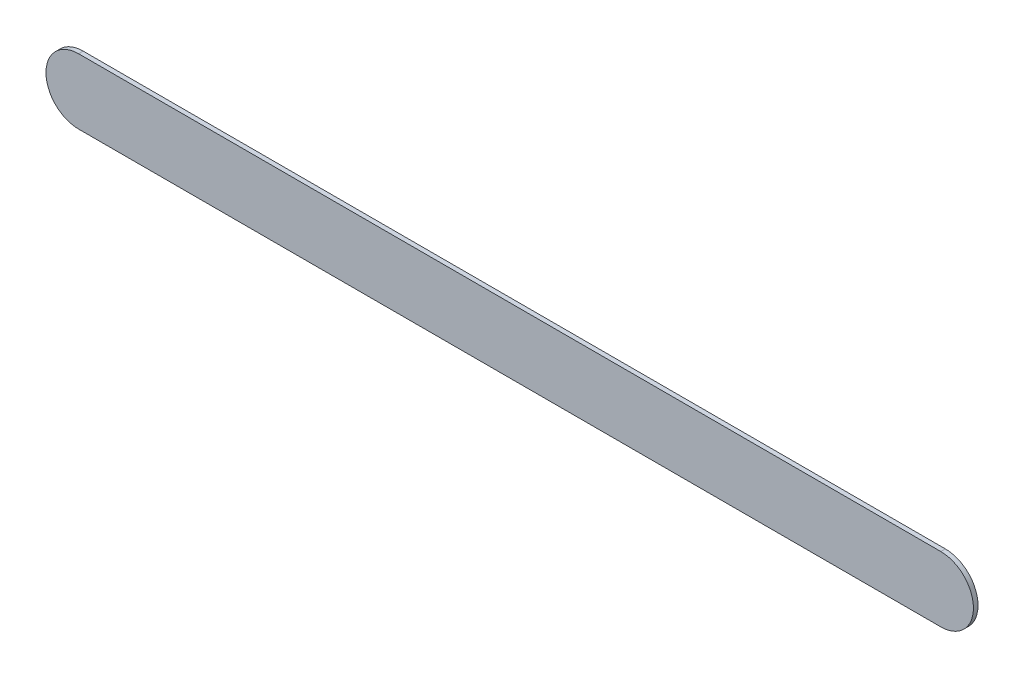
ISO-10303-21;
HEADER;
FILE_DESCRIPTION(('STEP AP214'),'2;1');
FILE_NAME('part.step','',(''),(''),'','','');
FILE_SCHEMA(('AUTOMOTIVE_DESIGN { 1 0 10303 214 1 1 1 1 }'));
ENDSEC;
DATA;
#1=APPLICATION_CONTEXT('core data for automotive mechanical design processes');
#2=APPLICATION_PROTOCOL_DEFINITION('international standard','automotive_design',2000,#1);
#3=PRODUCT_CONTEXT('',#1,'mechanical');
#4=PRODUCT('Part','Part','',(#3));
#5=PRODUCT_RELATED_PRODUCT_CATEGORY('part','',(#4));
#6=PRODUCT_DEFINITION_FORMATION('','',#4);
#7=PRODUCT_DEFINITION_CONTEXT('part definition',#1,'design');
#8=PRODUCT_DEFINITION('design','',#6,#7);
#9=PRODUCT_DEFINITION_SHAPE('','',#8);
#10=(LENGTH_UNIT() NAMED_UNIT(*) SI_UNIT(.MILLI.,.METRE.));
#11=(NAMED_UNIT(*) PLANE_ANGLE_UNIT() SI_UNIT($,.RADIAN.));
#12=(NAMED_UNIT(*) SI_UNIT($,.STERADIAN.) SOLID_ANGLE_UNIT());
#13=UNCERTAINTY_MEASURE_WITH_UNIT(LENGTH_MEASURE(1.E-05),#10,'distance_accuracy_value','');
#14=(GEOMETRIC_REPRESENTATION_CONTEXT(3) GLOBAL_UNCERTAINTY_ASSIGNED_CONTEXT((#13)) GLOBAL_UNIT_ASSIGNED_CONTEXT((#10,
#11,#12)) REPRESENTATION_CONTEXT('',''));
#15=CARTESIAN_POINT('',(0.,0.,0.));
#16=DIRECTION('',(0.,0.,1.));
#17=DIRECTION('',(1.,0.,0.));
#18=AXIS2_PLACEMENT_3D('',#15,#16,#17);
#19=CARTESIAN_POINT('',(129.032,-106.422,0.));
#20=DIRECTION('',(0.,0.,1.));
#21=DIRECTION('',(1.,0.,0.));
#22=AXIS2_PLACEMENT_3D('',#19,#20,#21);
#23=PLANE('',#22);
#24=DIRECTION('',(1.,0.,0.));
#25=VECTOR('',#24,1.);
#26=CARTESIAN_POINT('',(129.032,-106.422,0.));
#27=LINE('',#26,#25);
#28=CARTESIAN_POINT('',(129.032,-106.422,0.));
#29=VERTEX_POINT('',#28);
#30=CARTESIAN_POINT('',(135.636,-106.422,0.));
#31=VERTEX_POINT('',#30);
#32=EDGE_CURVE('E93',#29,#31,#27,.T.);
#33=ORIENTED_EDGE('',*,*,#32,.T.);
#34=CARTESIAN_POINT('',(135.636,-106.172,0.));
#35=DIRECTION('',(0.,0.,1.));
#36=DIRECTION('',(0.,-1.,0.));
#37=AXIS2_PLACEMENT_3D('',#34,#35,#36);
#38=CIRCLE('',#37,0.25);
#39=CARTESIAN_POINT('',(135.636,-105.922,0.));
#40=VERTEX_POINT('',#39);
#41=EDGE_CURVE('E71',#31,#40,#38,.T.);
#42=ORIENTED_EDGE('',*,*,#41,.T.);
#43=DIRECTION('',(-1.,0.,0.));
#44=VECTOR('',#43,1.);
#45=CARTESIAN_POINT('',(135.636,-105.922,0.));
#46=LINE('',#45,#44);
#47=CARTESIAN_POINT('',(129.032,-105.922,0.));
#48=VERTEX_POINT('',#47);
#49=EDGE_CURVE('E76',#40,#48,#46,.T.);
#50=ORIENTED_EDGE('',*,*,#49,.T.);
#51=CARTESIAN_POINT('',(129.032,-106.172,0.));
#52=DIRECTION('',(0.,0.,1.));
#53=DIRECTION('',(0.,1.,0.));
#54=AXIS2_PLACEMENT_3D('',#51,#52,#53);
#55=CIRCLE('',#54,0.25);
#56=EDGE_CURVE('E11',#48,#29,#55,.T.);
#57=ORIENTED_EDGE('',*,*,#56,.T.);
#58=EDGE_LOOP('',(#33,#42,#50,#57));
#59=FACE_BOUND('',#58,.T.);
#60=ADVANCED_FACE('F17',(#59),#23,.T.);
#61=CARTESIAN_POINT('',(129.032,-106.422,-0.035));
#62=DIRECTION('',(0.,0.,1.));
#63=DIRECTION('',(1.,0.,0.));
#64=AXIS2_PLACEMENT_3D('',#61,#62,#63);
#65=PLANE('',#64);
#66=CARTESIAN_POINT('',(129.032,-106.172,-0.035));
#67=DIRECTION('',(0.,0.,1.));
#68=DIRECTION('',(0.,1.,0.));
#69=AXIS2_PLACEMENT_3D('',#66,#67,#68);
#70=CIRCLE('',#69,0.25);
#71=CARTESIAN_POINT('',(129.032,-105.922,-0.035));
#72=VERTEX_POINT('',#71);
#73=CARTESIAN_POINT('',(129.032,-106.422,-0.035));
#74=VERTEX_POINT('',#73);
#75=EDGE_CURVE('E26',#72,#74,#70,.T.);
#76=ORIENTED_EDGE('',*,*,#75,.F.);
#77=DIRECTION('',(-1.,0.,0.));
#78=VECTOR('',#77,1.);
#79=CARTESIAN_POINT('',(135.636,-105.922,-0.035));
#80=LINE('',#79,#78);
#81=CARTESIAN_POINT('',(135.636,-105.922,-0.035));
#82=VERTEX_POINT('',#81);
#83=EDGE_CURVE('E61',#82,#72,#80,.T.);
#84=ORIENTED_EDGE('',*,*,#83,.F.);
#85=CARTESIAN_POINT('',(135.636,-106.172,-0.035));
#86=DIRECTION('',(0.,0.,1.));
#87=DIRECTION('',(0.,-1.,0.));
#88=AXIS2_PLACEMENT_3D('',#85,#86,#87);
#89=CIRCLE('',#88,0.25);
#90=CARTESIAN_POINT('',(135.636,-106.422,-0.035));
#91=VERTEX_POINT('',#90);
#92=EDGE_CURVE('E65',#91,#82,#89,.T.);
#93=ORIENTED_EDGE('',*,*,#92,.F.);
#94=DIRECTION('',(1.,0.,0.));
#95=VECTOR('',#94,1.);
#96=CARTESIAN_POINT('',(129.032,-106.422,-0.035));
#97=LINE('',#96,#95);
#98=EDGE_CURVE('E111',#74,#91,#97,.T.);
#99=ORIENTED_EDGE('',*,*,#98,.F.);
#100=EDGE_LOOP('',(#76,#84,#93,#99));
#101=FACE_BOUND('',#100,.T.);
#102=ADVANCED_FACE('F19',(#101),#65,.F.);
#103=CARTESIAN_POINT('',(129.032,-106.172,-0.035));
#104=DIRECTION('',(0.,0.,-1.));
#105=DIRECTION('',(0.,1.,0.));
#106=AXIS2_PLACEMENT_3D('',#103,#104,#105);
#107=CYLINDRICAL_SURFACE('',#106,0.25);
#108=ORIENTED_EDGE('',*,*,#75,.T.);
#109=DIRECTION('',(0.,0.,1.));
#110=VECTOR('',#109,1.);
#111=CARTESIAN_POINT('',(129.032,-106.422,-0.035));
#112=LINE('',#111,#110);
#113=EDGE_CURVE('E87',#74,#29,#112,.T.);
#114=ORIENTED_EDGE('',*,*,#113,.T.);
#115=ORIENTED_EDGE('',*,*,#56,.F.);
#116=DIRECTION('',(0.,0.,1.));
#117=VECTOR('',#116,1.);
#118=CARTESIAN_POINT('',(129.032,-105.922,-0.035));
#119=LINE('',#118,#117);
#120=EDGE_CURVE('E70',#72,#48,#119,.T.);
#121=ORIENTED_EDGE('',*,*,#120,.F.);
#122=EDGE_LOOP('',(#108,#114,#115,#121));
#123=FACE_BOUND('',#122,.T.);
#124=ADVANCED_FACE('F105',(#123),#107,.T.);
#125=CARTESIAN_POINT('',(135.636,-105.922,-0.035));
#126=DIRECTION('',(0.,-1.,0.));
#127=DIRECTION('',(0.,0.,-1.));
#128=AXIS2_PLACEMENT_3D('',#125,#126,#127);
#129=PLANE('',#128);
#130=ORIENTED_EDGE('',*,*,#83,.T.);
#131=ORIENTED_EDGE('',*,*,#120,.T.);
#132=ORIENTED_EDGE('',*,*,#49,.F.);
#133=DIRECTION('',(0.,0.,1.));
#134=VECTOR('',#133,1.);
#135=CARTESIAN_POINT('',(135.636,-105.922,-0.035));
#136=LINE('',#135,#134);
#137=EDGE_CURVE('E74',#82,#40,#136,.T.);
#138=ORIENTED_EDGE('',*,*,#137,.F.);
#139=EDGE_LOOP('',(#130,#131,#132,#138));
#140=FACE_BOUND('',#139,.T.);
#141=ADVANCED_FACE('F75',(#140),#129,.F.);
#142=CARTESIAN_POINT('',(135.636,-106.172,-0.035));
#143=DIRECTION('',(0.,0.,-1.));
#144=DIRECTION('',(0.,-1.,0.));
#145=AXIS2_PLACEMENT_3D('',#142,#143,#144);
#146=CYLINDRICAL_SURFACE('',#145,0.25);
#147=ORIENTED_EDGE('',*,*,#92,.T.);
#148=ORIENTED_EDGE('',*,*,#137,.T.);
#149=ORIENTED_EDGE('',*,*,#41,.F.);
#150=DIRECTION('',(0.,0.,1.));
#151=VECTOR('',#150,1.);
#152=CARTESIAN_POINT('',(135.636,-106.422,-0.035));
#153=LINE('',#152,#151);
#154=EDGE_CURVE('E84',#91,#31,#153,.T.);
#155=ORIENTED_EDGE('',*,*,#154,.F.);
#156=EDGE_LOOP('',(#147,#148,#149,#155));
#157=FACE_BOUND('',#156,.T.);
#158=ADVANCED_FACE('F82',(#157),#146,.T.);
#159=CARTESIAN_POINT('',(129.032,-106.422,-0.035));
#160=DIRECTION('',(0.,1.,0.));
#161=DIRECTION('',(1.,0.,0.));
#162=AXIS2_PLACEMENT_3D('',#159,#160,#161);
#163=PLANE('',#162);
#164=ORIENTED_EDGE('',*,*,#98,.T.);
#165=ORIENTED_EDGE('',*,*,#154,.T.);
#166=ORIENTED_EDGE('',*,*,#32,.F.);
#167=ORIENTED_EDGE('',*,*,#113,.F.);
#168=EDGE_LOOP('',(#164,#165,#166,#167));
#169=FACE_BOUND('',#168,.T.);
#170=ADVANCED_FACE('F110',(#169),#163,.F.);
#171=CLOSED_SHELL('',(#60,#102,#124,#141,#158,#170));
#172=MANIFOLD_SOLID_BREP('B1',#171);
#173=ADVANCED_BREP_SHAPE_REPRESENTATION('',(#18,#172),#14);
#174=SHAPE_DEFINITION_REPRESENTATION(#9,#173);
ENDSEC;
END-ISO-10303-21;
